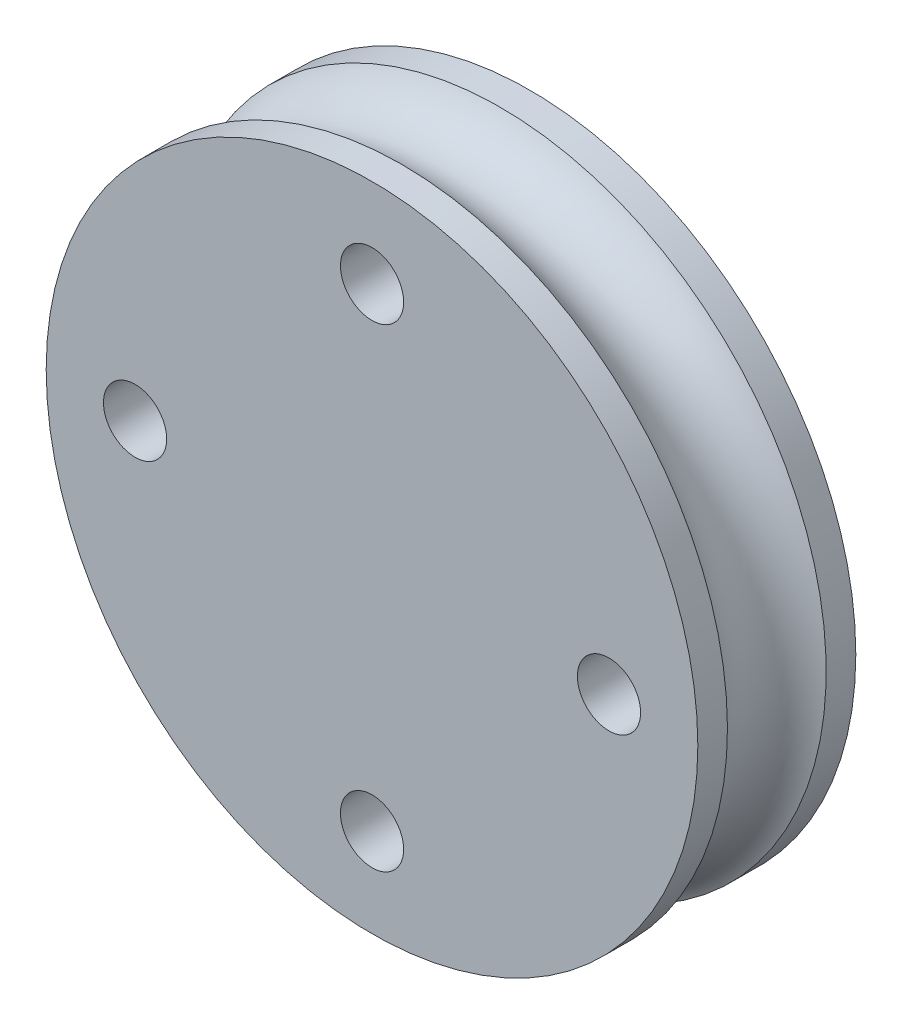
ISO-10303-21;
HEADER;
FILE_DESCRIPTION(('STEP AP214'),'2;1');
FILE_NAME('part.step','',(''),(''),'','','');
FILE_SCHEMA(('AUTOMOTIVE_DESIGN { 1 0 10303 214 1 1 1 1 }'));
ENDSEC;
DATA;
#1=APPLICATION_CONTEXT('core data for automotive mechanical design processes');
#2=APPLICATION_PROTOCOL_DEFINITION('international standard','automotive_design',2000,#1);
#3=PRODUCT_CONTEXT('',#1,'mechanical');
#4=PRODUCT('Part','Part','',(#3));
#5=PRODUCT_RELATED_PRODUCT_CATEGORY('part','',(#4));
#6=PRODUCT_DEFINITION_FORMATION('','',#4);
#7=PRODUCT_DEFINITION_CONTEXT('part definition',#1,'design');
#8=PRODUCT_DEFINITION('design','',#6,#7);
#9=PRODUCT_DEFINITION_SHAPE('','',#8);
#10=(LENGTH_UNIT() NAMED_UNIT(*) SI_UNIT(.MILLI.,.METRE.));
#11=(NAMED_UNIT(*) PLANE_ANGLE_UNIT() SI_UNIT($,.RADIAN.));
#12=(NAMED_UNIT(*) SI_UNIT($,.STERADIAN.) SOLID_ANGLE_UNIT());
#13=UNCERTAINTY_MEASURE_WITH_UNIT(LENGTH_MEASURE(1.E-05),#10,'distance_accuracy_value','');
#14=(GEOMETRIC_REPRESENTATION_CONTEXT(3) GLOBAL_UNCERTAINTY_ASSIGNED_CONTEXT((#13)) GLOBAL_UNIT_ASSIGNED_CONTEXT((#10,
#11,#12)) REPRESENTATION_CONTEXT('',''));
#15=CARTESIAN_POINT('',(0.,0.,0.));
#16=DIRECTION('',(0.,0.,1.));
#17=DIRECTION('',(1.,0.,0.));
#18=AXIS2_PLACEMENT_3D('',#15,#16,#17);
#19=CARTESIAN_POINT('',(-1.63986668050373E-06,-6.33557240791805E-06,4.));
#20=DIRECTION('',(0.,0.,-1.));
#21=DIRECTION('',(-1.,0.,0.));
#22=AXIS2_PLACEMENT_3D('',#19,#20,#21);
#23=CYLINDRICAL_SURFACE('',#22,8.25);
#24=CARTESIAN_POINT('',(-1.63986668050373E-06,-6.33557240791805E-06,0.75));
#25=DIRECTION('',(0.,0.,-1.));
#26=DIRECTION('',(-0.999999999999705,7.67948913047995E-07,0.));
#27=AXIS2_PLACEMENT_3D('',#24,#25,#26);
#28=CIRCLE('',#27,8.25);
#29=CARTESIAN_POINT('',(-8.25000163986425,6.12472791122973E-12,0.75));
#30=VERTEX_POINT('',#29);
#31=EDGE_CURVE('E64',#30,#30,#28,.T.);
#32=ORIENTED_EDGE('',*,*,#31,.T.);
#33=EDGE_LOOP('',(#32));
#34=FACE_BOUND('',#33,.T.);
#35=CARTESIAN_POINT('',(-1.63986668050373E-06,-6.33557240791805E-06,0.));
#36=DIRECTION('',(0.,0.,1.));
#37=DIRECTION('',(1.,0.,0.));
#38=AXIS2_PLACEMENT_3D('',#35,#36,#37);
#39=CIRCLE('',#38,8.25);
#40=CARTESIAN_POINT('',(8.24999836013332,-6.33557240791805E-06,0.));
#41=VERTEX_POINT('',#40);
#42=EDGE_CURVE('E48',#41,#41,#39,.T.);
#43=ORIENTED_EDGE('',*,*,#42,.T.);
#44=EDGE_LOOP('',(#43));
#45=FACE_BOUND('',#44,.T.);
#46=ADVANCED_FACE('F37',(#34,#45),#23,.T.);
#47=CARTESIAN_POINT('',(-1.63986668050373E-06,-6.33557240791805E-06,4.));
#48=DIRECTION('',(0.,0.,1.));
#49=DIRECTION('',(1.,0.,0.));
#50=AXIS2_PLACEMENT_3D('',#47,#48,#49);
#51=PLANE('',#50);
#52=CARTESIAN_POINT('',(-5.99942925563324,0.000379921115892694,4.));
#53=DIRECTION('',(0.,0.,1.));
#54=DIRECTION('',(1.,0.,0.));
#55=AXIS2_PLACEMENT_3D('',#52,#53,#54);
#56=CIRCLE('',#55,0.800000000000001);
#57=CARTESIAN_POINT('',(-5.19942925563324,0.000379921115892694,4.));
#58=VERTEX_POINT('',#57);
#59=EDGE_CURVE('E119',#58,#58,#56,.T.);
#60=ORIENTED_EDGE('',*,*,#59,.F.);
#61=EDGE_LOOP('',(#60));
#62=FACE_BOUND('',#61,.T.);
#63=CARTESIAN_POINT('',(6.00057074436676,0.000379921115892694,4.));
#64=DIRECTION('',(0.,0.,1.));
#65=DIRECTION('',(1.,0.,0.));
#66=AXIS2_PLACEMENT_3D('',#63,#64,#65);
#67=CIRCLE('',#66,0.800000000000001);
#68=CARTESIAN_POINT('',(6.80057074436676,0.000379921115892694,4.));
#69=VERTEX_POINT('',#68);
#70=EDGE_CURVE('E54',#69,#69,#67,.T.);
#71=ORIENTED_EDGE('',*,*,#70,.F.);
#72=EDGE_LOOP('',(#71));
#73=FACE_BOUND('',#72,.T.);
#74=CARTESIAN_POINT('',(-1.63986668050373E-06,-6.33557240791805E-06,4.));
#75=DIRECTION('',(0.,0.,1.));
#76=DIRECTION('',(1.,0.,0.));
#77=AXIS2_PLACEMENT_3D('',#74,#75,#76);
#78=CIRCLE('',#77,8.25);
#79=CARTESIAN_POINT('',(8.24999836013332,-6.33557240791805E-06,4.));
#80=VERTEX_POINT('',#79);
#81=EDGE_CURVE('E10',#80,#80,#78,.T.);
#82=ORIENTED_EDGE('',*,*,#81,.T.);
#83=EDGE_LOOP('',(#82));
#84=FACE_BOUND('',#83,.T.);
#85=CARTESIAN_POINT('',(0.000570744366760466,6.00037992111589,4.));
#86=DIRECTION('',(0.,0.,1.));
#87=DIRECTION('',(1.,0.,0.));
#88=AXIS2_PLACEMENT_3D('',#85,#86,#87);
#89=CIRCLE('',#88,0.800000000000003);
#90=CARTESIAN_POINT('',(0.800570744366764,6.00037992111589,4.));
#91=VERTEX_POINT('',#90);
#92=EDGE_CURVE('E127',#91,#91,#89,.T.);
#93=ORIENTED_EDGE('',*,*,#92,.F.);
#94=EDGE_LOOP('',(#93));
#95=FACE_BOUND('',#94,.T.);
#96=CARTESIAN_POINT('',(0.000570744366760466,-5.99962007888411,4.));
#97=DIRECTION('',(0.,0.,1.));
#98=DIRECTION('',(1.,0.,0.));
#99=AXIS2_PLACEMENT_3D('',#96,#97,#98);
#100=CIRCLE('',#99,0.800000000000003);
#101=CARTESIAN_POINT('',(0.800570744366764,-5.99962007888411,4.));
#102=VERTEX_POINT('',#101);
#103=EDGE_CURVE('E110',#102,#102,#100,.T.);
#104=ORIENTED_EDGE('',*,*,#103,.F.);
#105=EDGE_LOOP('',(#104));
#106=FACE_BOUND('',#105,.T.);
#107=ADVANCED_FACE('F157',(#62,#73,#84,#95,#106),#51,.T.);
#108=CARTESIAN_POINT('',(-1.63986668050373E-06,-6.33557240791805E-06,0.));
#109=DIRECTION('',(0.,0.,1.));
#110=DIRECTION('',(1.,0.,0.));
#111=AXIS2_PLACEMENT_3D('',#108,#109,#110);
#112=PLANE('',#111);
#113=ORIENTED_EDGE('',*,*,#42,.F.);
#114=EDGE_LOOP('',(#113));
#115=FACE_BOUND('',#114,.T.);
#116=CARTESIAN_POINT('',(6.00057074436676,0.000379921115892694,0.));
#117=DIRECTION('',(0.,0.,1.));
#118=DIRECTION('',(1.,0.,0.));
#119=AXIS2_PLACEMENT_3D('',#116,#117,#118);
#120=CIRCLE('',#119,0.800000000000001);
#121=CARTESIAN_POINT('',(6.80057074436676,0.000379921115892694,0.));
#122=VERTEX_POINT('',#121);
#123=EDGE_CURVE('E57',#122,#122,#120,.T.);
#124=ORIENTED_EDGE('',*,*,#123,.T.);
#125=EDGE_LOOP('',(#124));
#126=FACE_BOUND('',#125,.T.);
#127=CARTESIAN_POINT('',(0.000570744366760466,6.00037992111589,0.));
#128=DIRECTION('',(0.,0.,1.));
#129=DIRECTION('',(1.,0.,0.));
#130=AXIS2_PLACEMENT_3D('',#127,#128,#129);
#131=CIRCLE('',#130,0.800000000000003);
#132=CARTESIAN_POINT('',(0.800570744366764,6.00037992111589,0.));
#133=VERTEX_POINT('',#132);
#134=EDGE_CURVE('E123',#133,#133,#131,.T.);
#135=ORIENTED_EDGE('',*,*,#134,.T.);
#136=EDGE_LOOP('',(#135));
#137=FACE_BOUND('',#136,.T.);
#138=CARTESIAN_POINT('',(-5.99942925563324,0.000379921115892694,0.));
#139=DIRECTION('',(0.,0.,1.));
#140=DIRECTION('',(1.,0.,0.));
#141=AXIS2_PLACEMENT_3D('',#138,#139,#140);
#142=CIRCLE('',#141,0.800000000000001);
#143=CARTESIAN_POINT('',(-5.19942925563324,0.000379921115892694,0.));
#144=VERTEX_POINT('',#143);
#145=EDGE_CURVE('E116',#144,#144,#142,.T.);
#146=ORIENTED_EDGE('',*,*,#145,.T.);
#147=EDGE_LOOP('',(#146));
#148=FACE_BOUND('',#147,.T.);
#149=CARTESIAN_POINT('',(0.000570744366760466,-5.99962007888411,0.));
#150=DIRECTION('',(0.,0.,1.));
#151=DIRECTION('',(1.,0.,0.));
#152=AXIS2_PLACEMENT_3D('',#149,#150,#151);
#153=CIRCLE('',#152,0.800000000000003);
#154=CARTESIAN_POINT('',(0.800570744366764,-5.99962007888411,0.));
#155=VERTEX_POINT('',#154);
#156=EDGE_CURVE('E107',#155,#155,#153,.T.);
#157=ORIENTED_EDGE('',*,*,#156,.T.);
#158=EDGE_LOOP('',(#157));
#159=FACE_BOUND('',#158,.T.);
#160=ADVANCED_FACE('F141',(#115,#126,#137,#148,#159),#112,.F.);
#161=CARTESIAN_POINT('',(-8.24999366442759,0.,3.25));
#162=CARTESIAN_POINT('',(-8.24999652790779,0.134990341986678,3.25));
#163=CARTESIAN_POINT('',(-8.24668060825436,0.269980440319253,3.25));
#164=CARTESIAN_POINT('',(-8.23343176324912,0.539635564339537,3.25));
#165=CARTESIAN_POINT('',(-8.2234988378973,0.674300590027244,3.25));
#166=CARTESIAN_POINT('',(-8.19703654206415,0.942980983421126,3.25));
#167=CARTESIAN_POINT('',(-8.18050717158282,1.0769963511273,3.25));
#168=CARTESIAN_POINT('',(-8.14089270883726,1.34405461814308,3.25));
#169=CARTESIAN_POINT('',(-8.11780761657305,1.47709751745268,3.25));
#170=CARTESIAN_POINT('',(-8.06513708240793,1.74189032379572,3.25));
#171=CARTESIAN_POINT('',(-8.03555164050703,1.87364023082915,3.25));
#172=CARTESIAN_POINT('',(-7.96995174579646,2.13552965873765,3.25));
#173=CARTESIAN_POINT('',(-7.9339372929868,2.26566917961272,3.25));
#174=CARTESIAN_POINT('',(-7.85556612106506,2.52402431684673,3.25));
#175=CARTESIAN_POINT('',(-7.81320940195298,2.65223993320567,3.25));
#176=CARTESIAN_POINT('',(-7.72225574312566,2.90643837898584,3.25));
#177=CARTESIAN_POINT('',(-7.67365880341043,3.03242120840708,3.25));
#178=CARTESIAN_POINT('',(-7.57034177641445,3.28185057657971,3.25));
#179=CARTESIAN_POINT('',(-7.51562168913369,3.40529711533112,3.25));
#180=CARTESIAN_POINT('',(-7.40019019282388,3.64935650865603,3.25));
#181=CARTESIAN_POINT('',(-7.33947878379483,3.76996936322953,3.25));
#182=CARTESIAN_POINT('',(-7.21221090300097,4.00807082126312,3.25));
#183=CARTESIAN_POINT('',(-7.14565443123616,4.1255594247232,3.25));
#184=CARTESIAN_POINT('',(-7.0068567653649,4.35712934019463,3.25));
#185=CARTESIAN_POINT('',(-6.93461557125845,4.47121065220597,3.25));
#186=CARTESIAN_POINT('',(-6.78462249606168,4.69569115290659,3.25));
#187=CARTESIAN_POINT('',(-6.70687061497135,4.80609034159588,3.25));
#188=CARTESIAN_POINT('',(-6.54604347690034,5.02294063433712,3.25));
#189=CARTESIAN_POINT('',(-6.46296821991967,5.12939173838906,3.25));
#190=CARTESIAN_POINT('',(-6.2916944656381,5.33808941182191,3.25));
#191=CARTESIAN_POINT('',(-6.20349596833721,5.44033598120282,3.25));
#192=CARTESIAN_POINT('',(-6.02218821132061,5.64037826435221,3.25));
#193=CARTESIAN_POINT('',(-5.9290789516049,5.7381739781207,3.25));
#194=CARTESIAN_POINT('',(-5.73817397812071,5.9290789516049,3.25));
#195=CARTESIAN_POINT('',(-5.64037826435221,6.02218821132062,3.25));
#196=CARTESIAN_POINT('',(-5.44033598120282,6.2034959683372,3.25));
#197=CARTESIAN_POINT('',(-5.33808941182191,6.29169446563807,3.25));
#198=CARTESIAN_POINT('',(-5.12939173838906,6.46296821991969,3.25));
#199=CARTESIAN_POINT('',(-5.02294063433712,6.54604347690045,3.25));
#200=CARTESIAN_POINT('',(-4.80609034159588,6.70687061497124,3.25));
#201=CARTESIAN_POINT('',(-4.69569115290657,6.78462249606128,3.25));
#202=CARTESIAN_POINT('',(-4.47121065220599,6.93461557125884,3.25));
#203=CARTESIAN_POINT('',(-4.3571293401947,7.00685676536636,3.25));
#204=CARTESIAN_POINT('',(-4.12555942472313,7.1456544312347,3.25));
#205=CARTESIAN_POINT('',(-4.00807082126285,7.21221090299551,3.25));
#206=CARTESIAN_POINT('',(-3.7699693632298,7.33947878380029,3.25));
#207=CARTESIAN_POINT('',(-3.64935650865703,7.40019019284427,3.25));
#208=CARTESIAN_POINT('',(-3.40529711533012,7.5156216891133,3.25));
#209=CARTESIAN_POINT('',(-3.28185057657598,7.57034177633836,3.25));
#210=CARTESIAN_POINT('',(-3.03242120841081,7.67365880348652,3.25));
#211=CARTESIAN_POINT('',(-2.90643837899979,7.72225574340963,3.25));
#212=CARTESIAN_POINT('',(-2.65223993319172,7.81320940166902,3.25));
#213=CARTESIAN_POINT('',(-2.52402431679466,7.8555661200053,3.25));
#214=CARTESIAN_POINT('',(-2.26566917966478,7.93393729404657,3.25));
#215=CARTESIAN_POINT('',(-2.13552965893196,7.96995174975156,3.25));
#216=CARTESIAN_POINT('',(-1.87364023063485,8.03555163655193,3.25));
#217=CARTESIAN_POINT('',(-1.74189032307057,8.06513706764733,3.25));
#218=CARTESIAN_POINT('',(-1.47709751817782,8.11780763133365,3.25));
#219=CARTESIAN_POINT('',(-1.34405462084934,8.14089276392457,3.25));
#220=CARTESIAN_POINT('',(-1.07699634842104,8.18050711649551,3.25));
#221=CARTESIAN_POINT('',(-0.942980973321206,8.19703633647553,3.25));
#222=CARTESIAN_POINT('',(-0.674300600127167,8.22349904348593,3.25));
#223=CARTESIAN_POINT('',(-0.539635602032958,8.23343253051632,3.25));
#224=CARTESIAN_POINT('',(-0.269980402625833,8.24667984098715,3.25));
#225=CARTESIAN_POINT('',(-0.134990201312917,8.24999366442759,3.25));
#226=CARTESIAN_POINT('',(0.134990201312916,8.24999366442759,3.25));
#227=CARTESIAN_POINT('',(0.269980402625833,8.24667984098715,3.25));
#228=CARTESIAN_POINT('',(0.539635602032957,8.23343253051632,3.25));
#229=CARTESIAN_POINT('',(0.674300600127166,8.22349904348593,3.25));
#230=CARTESIAN_POINT('',(0.942980973321205,8.19703633647553,3.25));
#231=CARTESIAN_POINT('',(1.07699634842103,8.18050711649551,3.25));
#232=CARTESIAN_POINT('',(1.34405462084934,8.14089276392457,3.25));
#233=CARTESIAN_POINT('',(1.47709751817782,8.11780763133365,3.25));
#234=CARTESIAN_POINT('',(1.74189032307057,8.06513706764733,3.25));
#235=CARTESIAN_POINT('',(1.87364023063485,8.03555163655193,3.25));
#236=CARTESIAN_POINT('',(2.13552965893195,7.96995174975156,3.25));
#237=CARTESIAN_POINT('',(2.26566917966478,7.93393729404657,3.25));
#238=CARTESIAN_POINT('',(2.52402431679466,7.8555661200053,3.25));
#239=CARTESIAN_POINT('',(2.65223993319172,7.81320940166902,3.25));
#240=CARTESIAN_POINT('',(2.90643837899979,7.72225574340963,3.25));
#241=CARTESIAN_POINT('',(3.03242120841081,7.67365880348652,3.25));
#242=CARTESIAN_POINT('',(3.28185057657598,7.57034177633836,3.25));
#243=CARTESIAN_POINT('',(3.40529711533012,7.5156216891133,3.25));
#244=CARTESIAN_POINT('',(3.64935650865703,7.40019019284427,3.25));
#245=CARTESIAN_POINT('',(3.76996936322979,7.33947878380029,3.25));
#246=CARTESIAN_POINT('',(4.00807082126285,7.21221090299551,3.25));
#247=CARTESIAN_POINT('',(4.12555942472313,7.1456544312347,3.25));
#248=CARTESIAN_POINT('',(4.3571293401947,7.00685676536636,3.25));
#249=CARTESIAN_POINT('',(4.47121065220598,6.93461557125885,3.25));
#250=CARTESIAN_POINT('',(4.69569115290657,6.78462249606129,3.25));
#251=CARTESIAN_POINT('',(4.80609034159587,6.70687061497124,3.25));
#252=CARTESIAN_POINT('',(5.02294063433712,6.54604347690045,3.25));
#253=CARTESIAN_POINT('',(5.12939173838906,6.46296821991969,3.25));
#254=CARTESIAN_POINT('',(5.33808941182191,6.29169446563807,3.25));
#255=CARTESIAN_POINT('',(5.44033598120282,6.2034959683372,3.25));
#256=CARTESIAN_POINT('',(5.64037826435221,6.02218821132062,3.25));
#257=CARTESIAN_POINT('',(5.7381739781207,5.9290789516049,3.25));
#258=CARTESIAN_POINT('',(5.9290789516049,5.73817397812071,3.25));
#259=CARTESIAN_POINT('',(6.02218821132062,5.64037826435222,3.25));
#260=CARTESIAN_POINT('',(6.2034959683372,5.44033598120282,3.25));
#261=CARTESIAN_POINT('',(6.29169446563807,5.33808941182191,3.25));
#262=CARTESIAN_POINT('',(6.46296821991969,5.12939173838906,3.25));
#263=CARTESIAN_POINT('',(6.54604347690045,5.02294063433712,3.25));
#264=CARTESIAN_POINT('',(6.70687061497124,4.80609034159588,3.25));
#265=CARTESIAN_POINT('',(6.78462249606128,4.69569115290657,3.25));
#266=CARTESIAN_POINT('',(6.93461557125884,4.47121065220599,3.25));
#267=CARTESIAN_POINT('',(7.00685676536636,4.3571293401947,3.25));
#268=CARTESIAN_POINT('',(7.14565443123469,4.12555942472313,3.25));
#269=CARTESIAN_POINT('',(7.21221090299551,4.00807082126285,3.25));
#270=CARTESIAN_POINT('',(7.33947878380029,3.7699693632298,3.25));
#271=CARTESIAN_POINT('',(7.40019019284427,3.64935650865703,3.25));
#272=CARTESIAN_POINT('',(7.5156216891133,3.40529711533012,3.25));
#273=CARTESIAN_POINT('',(7.57034177633836,3.28185057657598,3.25));
#274=CARTESIAN_POINT('',(7.67365880348652,3.03242120841082,3.25));
#275=CARTESIAN_POINT('',(7.72225574340963,2.9064383789998,3.25));
#276=CARTESIAN_POINT('',(7.81320940166901,2.65223993319172,3.25));
#277=CARTESIAN_POINT('',(7.8555661200053,2.52402431679466,3.25));
#278=CARTESIAN_POINT('',(7.93393729404657,2.26566917966478,3.25));
#279=CARTESIAN_POINT('',(7.96995174975156,2.13552965893196,3.25));
#280=CARTESIAN_POINT('',(8.03555163655193,1.87364023063485,3.25));
#281=CARTESIAN_POINT('',(8.06513706764733,1.74189032307058,3.25));
#282=CARTESIAN_POINT('',(8.11780763133365,1.47709751817782,3.25));
#283=CARTESIAN_POINT('',(8.14089276392457,1.34405462084934,3.25));
#284=CARTESIAN_POINT('',(8.18050711649551,1.07699634842104,3.25));
#285=CARTESIAN_POINT('',(8.19703633647553,0.942980973321206,3.25));
#286=CARTESIAN_POINT('',(8.22349904348593,0.674300600127167,3.25));
#287=CARTESIAN_POINT('',(8.23343253051632,0.539635602032958,3.25));
#288=CARTESIAN_POINT('',(8.24667984098715,0.269980402625833,3.25));
#289=CARTESIAN_POINT('',(8.24999366442759,0.134990201312917,3.25));
#290=CARTESIAN_POINT('',(8.24999366442759,-0.134990201312915,3.25));
#291=CARTESIAN_POINT('',(8.24667984098715,-0.269980402625831,3.25));
#292=CARTESIAN_POINT('',(8.23343253051632,-0.539635602032956,3.25));
#293=CARTESIAN_POINT('',(8.22349904348593,-0.674300600127165,3.25));
#294=CARTESIAN_POINT('',(8.19703633647553,-0.942980973321204,3.25));
#295=CARTESIAN_POINT('',(8.18050711649551,-1.07699634842103,3.25));
#296=CARTESIAN_POINT('',(8.14089276392457,-1.34405462084934,3.25));
#297=CARTESIAN_POINT('',(8.11780763133365,-1.47709751817782,3.25));
#298=CARTESIAN_POINT('',(8.06513706764733,-1.74189032307057,3.25));
#299=CARTESIAN_POINT('',(8.03555163655193,-1.87364023063485,3.25));
#300=CARTESIAN_POINT('',(7.96995174975156,-2.13552965893195,3.25));
#301=CARTESIAN_POINT('',(7.93393729404657,-2.26566917966478,3.25));
#302=CARTESIAN_POINT('',(7.8555661200053,-2.52402431679466,3.25));
#303=CARTESIAN_POINT('',(7.81320940166902,-2.65223993319172,3.25));
#304=CARTESIAN_POINT('',(7.72225574340963,-2.90643837899979,3.25));
#305=CARTESIAN_POINT('',(7.67365880348652,-3.03242120841081,3.25));
#306=CARTESIAN_POINT('',(7.57034177633836,-3.28185057657598,3.25));
#307=CARTESIAN_POINT('',(7.5156216891133,-3.40529711533012,3.25));
#308=CARTESIAN_POINT('',(7.40019019284427,-3.64935650865703,3.25));
#309=CARTESIAN_POINT('',(7.33947878380029,-3.76996936322979,3.25));
#310=CARTESIAN_POINT('',(7.21221090299551,-4.00807082126285,3.25));
#311=CARTESIAN_POINT('',(7.1456544312347,-4.12555942472313,3.25));
#312=CARTESIAN_POINT('',(7.00685676536636,-4.3571293401947,3.25));
#313=CARTESIAN_POINT('',(6.93461557125885,-4.47121065220598,3.25));
#314=CARTESIAN_POINT('',(6.78462249606129,-4.69569115290657,3.25));
#315=CARTESIAN_POINT('',(6.70687061497124,-4.80609034159587,3.25));
#316=CARTESIAN_POINT('',(6.54604347690045,-5.02294063433712,3.25));
#317=CARTESIAN_POINT('',(6.46296821991969,-5.12939173838906,3.25));
#318=CARTESIAN_POINT('',(6.29169446563807,-5.33808941182191,3.25));
#319=CARTESIAN_POINT('',(6.2034959683372,-5.44033598120282,3.25));
#320=CARTESIAN_POINT('',(6.02218821132062,-5.64037826435221,3.25));
#321=CARTESIAN_POINT('',(5.92907895160491,-5.7381739781207,3.25));
#322=CARTESIAN_POINT('',(5.73817397812071,-5.9290789516049,3.25));
#323=CARTESIAN_POINT('',(5.64037826435222,-6.02218821132062,3.25));
#324=CARTESIAN_POINT('',(5.44033598120282,-6.2034959683372,3.25));
#325=CARTESIAN_POINT('',(5.33808941182192,-6.29169446563807,3.25));
#326=CARTESIAN_POINT('',(5.12939173838907,-6.46296821991969,3.25));
#327=CARTESIAN_POINT('',(5.02294063433712,-6.54604347690045,3.25));
#328=CARTESIAN_POINT('',(4.80609034159587,-6.70687061497124,3.25));
#329=CARTESIAN_POINT('',(4.69569115290657,-6.78462249606128,3.25));
#330=CARTESIAN_POINT('',(4.47121065220599,-6.93461557125884,3.25));
#331=CARTESIAN_POINT('',(4.3571293401947,-7.00685676536636,3.25));
#332=CARTESIAN_POINT('',(4.12555942472313,-7.14565443123469,3.25));
#333=CARTESIAN_POINT('',(4.00807082126285,-7.21221090299551,3.25));
#334=CARTESIAN_POINT('',(3.7699693632298,-7.33947878380029,3.25));
#335=CARTESIAN_POINT('',(3.64935650865703,-7.40019019284427,3.25));
#336=CARTESIAN_POINT('',(3.40529711533012,-7.5156216891133,3.25));
#337=CARTESIAN_POINT('',(3.28185057657598,-7.57034177633836,3.25));
#338=CARTESIAN_POINT('',(3.03242120841082,-7.67365880348652,3.25));
#339=CARTESIAN_POINT('',(2.90643837899979,-7.72225574340963,3.25));
#340=CARTESIAN_POINT('',(2.65223993319172,-7.81320940166902,3.25));
#341=CARTESIAN_POINT('',(2.52402431679466,-7.8555661200053,3.25));
#342=CARTESIAN_POINT('',(2.26566917966478,-7.93393729404657,3.25));
#343=CARTESIAN_POINT('',(2.13552965893196,-7.96995174975156,3.25));
#344=CARTESIAN_POINT('',(1.87364023063485,-8.03555163655193,3.25));
#345=CARTESIAN_POINT('',(1.74189032307058,-8.06513706764733,3.25));
#346=CARTESIAN_POINT('',(1.47709751817782,-8.11780763133365,3.25));
#347=CARTESIAN_POINT('',(1.34405462084935,-8.14089276392457,3.25));
#348=CARTESIAN_POINT('',(1.07699634842104,-8.18050711649551,3.25));
#349=CARTESIAN_POINT('',(0.942980973321205,-8.19703633647553,3.25));
#350=CARTESIAN_POINT('',(0.674300600127165,-8.22349904348593,3.25));
#351=CARTESIAN_POINT('',(0.539635602032957,-8.23343253051632,3.25));
#352=CARTESIAN_POINT('',(0.269980402625833,-8.24667984098715,3.25));
#353=CARTESIAN_POINT('',(0.134990201312917,-8.24999366442759,3.25));
#354=CARTESIAN_POINT('',(-0.134990201312914,-8.24999366442759,3.25));
#355=CARTESIAN_POINT('',(-0.26998040262583,-8.24667984098715,3.25));
#356=CARTESIAN_POINT('',(-0.539635602032954,-8.23343253051632,3.25));
#357=CARTESIAN_POINT('',(-0.674300600127162,-8.22349904348593,3.25));
#358=CARTESIAN_POINT('',(-0.942980973321202,-8.19703633647553,3.25));
#359=CARTESIAN_POINT('',(-1.07699634842103,-8.18050711649551,3.25));
#360=CARTESIAN_POINT('',(-1.34405462084934,-8.14089276392457,3.25));
#361=CARTESIAN_POINT('',(-1.47709751817782,-8.11780763133365,3.25));
#362=CARTESIAN_POINT('',(-1.74189032307057,-8.06513706764733,3.25));
#363=CARTESIAN_POINT('',(-1.87364023063485,-8.03555163655193,3.25));
#364=CARTESIAN_POINT('',(-2.13552965893195,-7.96995174975156,3.25));
#365=CARTESIAN_POINT('',(-2.26566917966478,-7.93393729404657,3.25));
#366=CARTESIAN_POINT('',(-2.52402431679466,-7.8555661200053,3.25));
#367=CARTESIAN_POINT('',(-2.65223993319171,-7.81320940166902,3.25));
#368=CARTESIAN_POINT('',(-2.90643837899979,-7.72225574340963,3.25));
#369=CARTESIAN_POINT('',(-3.03242120841081,-7.67365880348652,3.25));
#370=CARTESIAN_POINT('',(-3.28185057657598,-7.57034177633836,3.25));
#371=CARTESIAN_POINT('',(-3.40529711533012,-7.5156216891133,3.25));
#372=CARTESIAN_POINT('',(-3.64935650865703,-7.40019019284427,3.25));
#373=CARTESIAN_POINT('',(-3.76996936322979,-7.33947878380029,3.25));
#374=CARTESIAN_POINT('',(-4.00807082126285,-7.21221090299551,3.25));
#375=CARTESIAN_POINT('',(-4.12555942472313,-7.1456544312347,3.25));
#376=CARTESIAN_POINT('',(-4.3571293401947,-7.00685676536637,3.25));
#377=CARTESIAN_POINT('',(-4.47121065220598,-6.93461557125885,3.25));
#378=CARTESIAN_POINT('',(-4.69569115290657,-6.78462249606129,3.25));
#379=CARTESIAN_POINT('',(-4.80609034159587,-6.70687061497125,3.25));
#380=CARTESIAN_POINT('',(-5.02294063433712,-6.54604347690045,3.25));
#381=CARTESIAN_POINT('',(-5.12939173838906,-6.46296821991969,3.25));
#382=CARTESIAN_POINT('',(-5.33808941182191,-6.29169446563807,3.25));
#383=CARTESIAN_POINT('',(-5.44033598120282,-6.2034959683372,3.25));
#384=CARTESIAN_POINT('',(-5.64037826435221,-6.02218821132062,3.25));
#385=CARTESIAN_POINT('',(-5.73817397812071,-5.92907895160491,3.25));
#386=CARTESIAN_POINT('',(-5.9290789516049,-5.73817397812071,3.25));
#387=CARTESIAN_POINT('',(-6.02218821132061,-5.64037826435222,3.25));
#388=CARTESIAN_POINT('',(-6.2034959683372,-5.44033598120282,3.25));
#389=CARTESIAN_POINT('',(-6.29169446563809,-5.33808941182192,3.25));
#390=CARTESIAN_POINT('',(-6.46296821991966,-5.12939173838906,3.25));
#391=CARTESIAN_POINT('',(-6.54604347690034,-5.02294063433712,3.25));
#392=CARTESIAN_POINT('',(-6.70687061497135,-4.80609034159588,3.25));
#393=CARTESIAN_POINT('',(-6.78462249606168,-4.69569115290659,3.25));
#394=CARTESIAN_POINT('',(-6.93461557125845,-4.47121065220597,3.25));
#395=CARTESIAN_POINT('',(-7.0068567653649,-4.35712934019463,3.25));
#396=CARTESIAN_POINT('',(-7.14565443123616,-4.12555942472321,3.25));
#397=CARTESIAN_POINT('',(-7.21221090300097,-4.00807082126312,3.25));
#398=CARTESIAN_POINT('',(-7.33947878379483,-3.76996936322953,3.25));
#399=CARTESIAN_POINT('',(-7.40019019282388,-3.64935650865603,3.25));
#400=CARTESIAN_POINT('',(-7.51562168913369,-3.40529711533113,3.25));
#401=CARTESIAN_POINT('',(-7.57034177641445,-3.28185057657972,3.25));
#402=CARTESIAN_POINT('',(-7.67365880341043,-3.03242120840708,3.25));
#403=CARTESIAN_POINT('',(-7.72225574312566,-2.90643837898584,3.25));
#404=CARTESIAN_POINT('',(-7.81320940195298,-2.65223993320567,3.25));
#405=CARTESIAN_POINT('',(-7.85556612106506,-2.52402431684673,3.25));
#406=CARTESIAN_POINT('',(-7.93393729298681,-2.26566917961272,3.25));
#407=CARTESIAN_POINT('',(-7.96995174579646,-2.13552965873766,3.25));
#408=CARTESIAN_POINT('',(-8.03555164050703,-1.87364023082916,3.25));
#409=CARTESIAN_POINT('',(-8.06513708240793,-1.74189032379572,3.25));
#410=CARTESIAN_POINT('',(-8.11780761657305,-1.47709751745268,3.25));
#411=CARTESIAN_POINT('',(-8.14089270883726,-1.34405461814308,3.25));
#412=CARTESIAN_POINT('',(-8.18050717158282,-1.0769963511273,3.25));
#413=CARTESIAN_POINT('',(-8.19703654206415,-0.942980983421128,3.25));
#414=CARTESIAN_POINT('',(-8.2234988378973,-0.674300590027244,3.25));
#415=CARTESIAN_POINT('',(-8.23343176324912,-0.539635564339537,3.25));
#416=CARTESIAN_POINT('',(-8.24668060825436,-0.269980440319255,3.25));
#417=CARTESIAN_POINT('',(-8.24999652790779,-0.134990341986679,3.25));
#418=CARTESIAN_POINT('',(-8.24999366442759,0.,3.25));
#419=B_SPLINE_CURVE_WITH_KNOTS('',3,(#161,#162,#163,#164,#165,#166,#167,#168,#169,#170,#171,
#172,#173,#174,#175,#176,#177,#178,#179,#180,#181,#182,#183,#184,#185,#186,#187,#188,#189,#190,
#191,#192,#193,#194,#195,#196,#197,#198,#199,#200,#201,#202,#203,#204,#205,#206,#207,#208,#209,
#210,#211,#212,#213,#214,#215,#216,#217,#218,#219,#220,#221,#222,#223,#224,#225,#226,#227,#228,
#229,#230,#231,#232,#233,#234,#235,#236,#237,#238,#239,#240,#241,#242,#243,#244,#245,#246,#247,
#248,#249,#250,#251,#252,#253,#254,#255,#256,#257,#258,#259,#260,#261,#262,#263,#264,#265,#266,
#267,#268,#269,#270,#271,#272,#273,#274,#275,#276,#277,#278,#279,#280,#281,#282,#283,#284,#285,
#286,#287,#288,#289,#290,#291,#292,#293,#294,#295,#296,#297,#298,#299,#300,#301,#302,#303,#304,
#305,#306,#307,#308,#309,#310,#311,#312,#313,#314,#315,#316,#317,#318,#319,#320,#321,#322,#323,
#324,#325,#326,#327,#328,#329,#330,#331,#332,#333,#334,#335,#336,#337,#338,#339,#340,#341,#342,
#343,#344,#345,#346,#347,#348,#349,#350,#351,#352,#353,#354,#355,#356,#357,#358,#359,#360,#361,
#362,#363,#364,#365,#366,#367,#368,#369,#370,#371,#372,#373,#374,#375,#376,#377,#378,#379,#380,
#381,#382,#383,#384,#385,#386,#387,#388,#389,#390,#391,#392,#393,#394,#395,#396,#397,#398,#399,
#400,#401,#402,#403,#404,#405,#406,#407,#408,#409,#410,#411,#412,#413,#414,#415,#416,#417,#418),
.UNSPECIFIED.,.F.,.F.,(4,2,2,2,2,2,2,2,2,2,2,2,2,2,2,2,2,2,2,2,2,2,2,2,2,2,2,2,2,2,2,2,2,2,2,2,
2,2,2,2,2,2,2,2,2,2,2,2,2,2,2,2,2,2,2,2,2,2,2,2,2,2,2,2,2,2,2,2,2,2,2,2,2,2,2,2,2,2,2,2,2,2,2,2,
2,2,2,2,2,2,2,2,2,2,2,2,2,2,2,2,2,2,2,2,2,2,2,2,2,2,2,2,2,2,2,2,2,2,2,2,2,2,2,2,2,2,2,2,4),(0.,
0.404929959662592,0.809859919325184,1.21478987898778,1.61971983865037,2.02464979831296,
2.42957975797555,2.83450971763815,3.23943967730074,3.64436963696333,4.04929959662592,
4.45422955628851,4.8591595159511,5.2640894756137,5.66901943527629,6.07394939493888,
6.47887935460147,6.88380931426407,7.28873927392666,7.69366923358925,8.09859919325184,
8.50352915291444,8.90845911257702,9.31338907223962,9.71831903190221,10.1232489915648,
10.5281789512274,10.93310891089,11.3380388705526,11.7429688302152,12.1478987898778,
12.5528287495404,12.9577587092029,13.3626886688655,13.7676186285281,14.1725485881907,
14.5774785478533,14.9824085075159,15.3873384671785,15.7922684268411,16.1971983865037,
16.6021283461663,17.0070583058289,17.4119882654915,17.8169182251541,18.2218481848166,
18.6267781444792,19.0317081041418,19.4366380638044,19.841568023467,20.2464979831296,
20.6514279427922,21.0563579024548,21.4612878621174,21.86621782178,22.2711477814426,
22.6760777411052,23.0810077007677,23.4859376604303,23.8908676200929,24.2957975797555,
24.7007275394181,25.1056574990807,25.5105874587433,25.9155174184059,26.3204473780685,
26.7253773377311,27.1303072973937,27.5352372570563,27.9401672167189,28.3450971763814,
28.750027136044,29.1549570957066,29.5598870553692,29.9648170150318,30.3697469746944,
30.774676934357,31.1796068940196,31.5845368536822,31.9894668133448,32.3943967730074,
32.79932673267,33.2042566923326,33.6091866519952,34.0141166116577,34.4190465713203,
34.8239765309829,35.2289064906455,35.6338364503081,36.0387664099707,36.4436963696333,
36.8486263292959,37.2535562889585,37.6584862486211,38.0634162082837,38.4683461679463,
38.8732761276088,39.2782060872714,39.683136046934,40.0880660065966,40.4929959662592,
40.8979259259218,41.3028558855844,41.707785845247,42.1127158049096,42.5176457645722,
42.9225757242348,43.3275056838974,43.7324356435599,44.1373656032225,44.5422955628851,
44.9472255225477,45.3521554822103,45.7570854418729,46.1620154015355,46.5669453611981,
46.9718753208607,47.3768052805233,47.7817352401859,48.1866651998485,48.5915951595111,
48.9965251191736,49.4014550788362,49.8063850384988,50.2113149981614,50.616244957824,
51.0211749174866,51.4261048771492,51.8310348368118),.UNSPECIFIED.);
#420=CARTESIAN_POINT('',(-8.24999366442759,0.,3.25));
#421=VERTEX_POINT('',#420);
#422=EDGE_CURVE('E102',#421,#421,#419,.T.);
#423=ORIENTED_EDGE('',*,*,#422,.F.);
#424=EDGE_LOOP('',(#423));
#425=FACE_BOUND('',#424,.T.);
#426=ORIENTED_EDGE('',*,*,#81,.F.);
#427=EDGE_LOOP('',(#426));
#428=FACE_BOUND('',#427,.T.);
#429=ADVANCED_FACE('F39',(#425,#428),#23,.T.);
#430=CARTESIAN_POINT('',(6.00057074436676,0.000379921115892694,4.));
#431=DIRECTION('',(0.,0.,-1.));
#432=DIRECTION('',(-1.,0.,0.));
#433=AXIS2_PLACEMENT_3D('',#430,#431,#432);
#434=CYLINDRICAL_SURFACE('',#433,0.800000000000001);
#435=ORIENTED_EDGE('',*,*,#70,.T.);
#436=EDGE_LOOP('',(#435));
#437=FACE_BOUND('',#436,.T.);
#438=ORIENTED_EDGE('',*,*,#123,.F.);
#439=EDGE_LOOP('',(#438));
#440=FACE_BOUND('',#439,.T.);
#441=ADVANCED_FACE('F144',(#437,#440),#434,.F.);
#442=CARTESIAN_POINT('',(0.000570744366760466,6.00037992111589,4.));
#443=DIRECTION('',(0.,0.,-1.));
#444=DIRECTION('',(-1.,0.,0.));
#445=AXIS2_PLACEMENT_3D('',#442,#443,#444);
#446=CYLINDRICAL_SURFACE('',#445,0.800000000000003);
#447=ORIENTED_EDGE('',*,*,#92,.T.);
#448=EDGE_LOOP('',(#447));
#449=FACE_BOUND('',#448,.T.);
#450=ORIENTED_EDGE('',*,*,#134,.F.);
#451=EDGE_LOOP('',(#450));
#452=FACE_BOUND('',#451,.T.);
#453=ADVANCED_FACE('F146',(#449,#452),#446,.F.);
#454=CARTESIAN_POINT('',(-5.99942925563324,0.000379921115892694,4.));
#455=DIRECTION('',(0.,0.,-1.));
#456=DIRECTION('',(-1.,0.,0.));
#457=AXIS2_PLACEMENT_3D('',#454,#455,#456);
#458=CYLINDRICAL_SURFACE('',#457,0.800000000000001);
#459=ORIENTED_EDGE('',*,*,#59,.T.);
#460=EDGE_LOOP('',(#459));
#461=FACE_BOUND('',#460,.T.);
#462=ORIENTED_EDGE('',*,*,#145,.F.);
#463=EDGE_LOOP('',(#462));
#464=FACE_BOUND('',#463,.T.);
#465=ADVANCED_FACE('F152',(#461,#464),#458,.F.);
#466=CARTESIAN_POINT('',(0.000570744366760466,-5.99962007888411,4.));
#467=DIRECTION('',(0.,0.,-1.));
#468=DIRECTION('',(-1.,0.,0.));
#469=AXIS2_PLACEMENT_3D('',#466,#467,#468);
#470=CYLINDRICAL_SURFACE('',#469,0.800000000000003);
#471=ORIENTED_EDGE('',*,*,#103,.T.);
#472=EDGE_LOOP('',(#471));
#473=FACE_BOUND('',#472,.T.);
#474=ORIENTED_EDGE('',*,*,#156,.F.);
#475=EDGE_LOOP('',(#474));
#476=FACE_BOUND('',#475,.T.);
#477=ADVANCED_FACE('F90',(#473,#476),#470,.F.);
#478=CARTESIAN_POINT('',(0.,0.,2.));
#479=DIRECTION('',(0.,0.,-1.));
#480=DIRECTION('',(-1.,0.,0.));
#481=AXIS2_PLACEMENT_3D('',#478,#479,#480);
#482=TOROIDAL_SURFACE('',#481,8.88046967507352,1.4);
#483=ORIENTED_EDGE('',*,*,#31,.F.);
#484=EDGE_LOOP('',(#483));
#485=FACE_BOUND('',#484,.T.);
#486=ORIENTED_EDGE('',*,*,#422,.T.);
#487=EDGE_LOOP('',(#486));
#488=FACE_BOUND('',#487,.T.);
#489=ADVANCED_FACE('F81',(#485,#488),#482,.F.);
#490=CLOSED_SHELL('',(#46,#107,#160,#429,#441,#453,#465,#477,#489));
#491=MANIFOLD_SOLID_BREP('B2',#490);
#492=ADVANCED_BREP_SHAPE_REPRESENTATION('',(#18,#491),#14);
#493=SHAPE_DEFINITION_REPRESENTATION(#9,#492);
ENDSEC;
END-ISO-10303-21;
